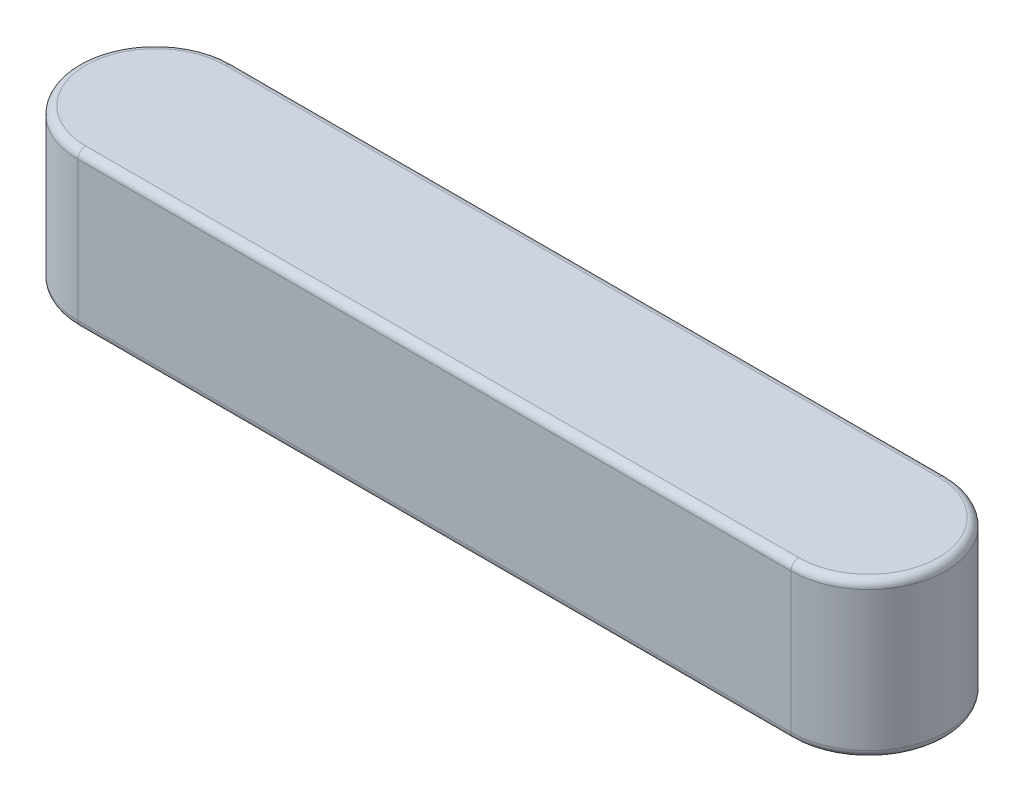
ISO-10303-21;
HEADER;
FILE_DESCRIPTION(('STEP AP214'),'2;1');
FILE_NAME('part.step','',(''),(''),'','','');
FILE_SCHEMA(('AUTOMOTIVE_DESIGN { 1 0 10303 214 1 1 1 1 }'));
ENDSEC;
DATA;
#1=APPLICATION_CONTEXT('core data for automotive mechanical design processes');
#2=APPLICATION_PROTOCOL_DEFINITION('international standard','automotive_design',2000,#1);
#3=PRODUCT_CONTEXT('',#1,'mechanical');
#4=PRODUCT('Part','Part','',(#3));
#5=PRODUCT_RELATED_PRODUCT_CATEGORY('part','',(#4));
#6=PRODUCT_DEFINITION_FORMATION('','',#4);
#7=PRODUCT_DEFINITION_CONTEXT('part definition',#1,'design');
#8=PRODUCT_DEFINITION('design','',#6,#7);
#9=PRODUCT_DEFINITION_SHAPE('','',#8);
#10=(LENGTH_UNIT() NAMED_UNIT(*) SI_UNIT(.MILLI.,.METRE.));
#11=(NAMED_UNIT(*) PLANE_ANGLE_UNIT() SI_UNIT($,.RADIAN.));
#12=(NAMED_UNIT(*) SI_UNIT($,.STERADIAN.) SOLID_ANGLE_UNIT());
#13=UNCERTAINTY_MEASURE_WITH_UNIT(LENGTH_MEASURE(1.E-05),#10,'distance_accuracy_value','');
#14=(GEOMETRIC_REPRESENTATION_CONTEXT(3) GLOBAL_UNCERTAINTY_ASSIGNED_CONTEXT((#13)) GLOBAL_UNIT_ASSIGNED_CONTEXT((#10,
#11,#12)) REPRESENTATION_CONTEXT('',''));
#15=CARTESIAN_POINT('',(0.,0.,0.));
#16=DIRECTION('',(0.,0.,1.));
#17=DIRECTION('',(1.,0.,0.));
#18=AXIS2_PLACEMENT_3D('',#15,#16,#17);
#19=CARTESIAN_POINT('',(-23.,5.,0.));
#20=DIRECTION('',(0.,-1.,0.));
#21=DIRECTION('',(0.,0.,-1.));
#22=AXIS2_PLACEMENT_3D('',#19,#20,#21);
#23=CYLINDRICAL_SURFACE('',#22,2.5);
#24=DIRECTION('',(0.,-1.,0.));
#25=VECTOR('',#24,1.);
#26=CARTESIAN_POINT('',(-23.,5.,-2.5));
#27=LINE('',#26,#25);
#28=CARTESIAN_POINT('',(-23.,4.75,-2.5));
#29=VERTEX_POINT('',#28);
#30=CARTESIAN_POINT('',(-23.,0.25,-2.5));
#31=VERTEX_POINT('',#30);
#32=EDGE_CURVE('E104',#29,#31,#27,.T.);
#33=ORIENTED_EDGE('',*,*,#32,.T.);
#34=CARTESIAN_POINT('',(-23.,0.25,0.));
#35=DIRECTION('',(0.,1.,0.));
#36=DIRECTION('',(0.,0.,1.));
#37=AXIS2_PLACEMENT_3D('',#34,#35,#36);
#38=CIRCLE('',#37,2.5);
#39=CARTESIAN_POINT('',(-23.,0.25,2.5));
#40=VERTEX_POINT('',#39);
#41=EDGE_CURVE('E111',#31,#40,#38,.T.);
#42=ORIENTED_EDGE('',*,*,#41,.T.);
#43=DIRECTION('',(0.,-1.,0.));
#44=VECTOR('',#43,1.);
#45=CARTESIAN_POINT('',(-23.,5.,2.5));
#46=LINE('',#45,#44);
#47=CARTESIAN_POINT('',(-23.,4.75,2.5));
#48=VERTEX_POINT('',#47);
#49=EDGE_CURVE('E106',#48,#40,#46,.T.);
#50=ORIENTED_EDGE('',*,*,#49,.F.);
#51=CARTESIAN_POINT('',(-23.,4.75,0.));
#52=DIRECTION('',(0.,1.,0.));
#53=DIRECTION('',(0.,0.,1.));
#54=AXIS2_PLACEMENT_3D('',#51,#52,#53);
#55=CIRCLE('',#54,2.5);
#56=EDGE_CURVE('E102',#48,#29,#55,.F.);
#57=ORIENTED_EDGE('',*,*,#56,.T.);
#58=EDGE_LOOP('',(#33,#42,#50,#57));
#59=FACE_BOUND('',#58,.T.);
#60=ADVANCED_FACE('F33',(#59),#23,.T.);
#61=CARTESIAN_POINT('',(-23.,5.,2.5));
#62=DIRECTION('',(0.,0.,-1.));
#63=DIRECTION('',(-1.,0.,0.));
#64=AXIS2_PLACEMENT_3D('',#61,#62,#63);
#65=PLANE('',#64);
#66=ORIENTED_EDGE('',*,*,#49,.T.);
#67=DIRECTION('',(1.,0.,0.));
#68=VECTOR('',#67,1.);
#69=CARTESIAN_POINT('',(-23.,0.25,2.5));
#70=LINE('',#69,#68);
#71=CARTESIAN_POINT('',(0.,0.25,2.5));
#72=VERTEX_POINT('',#71);
#73=EDGE_CURVE('E155',#40,#72,#70,.T.);
#74=ORIENTED_EDGE('',*,*,#73,.T.);
#75=DIRECTION('',(0.,-1.,0.));
#76=VECTOR('',#75,1.);
#77=CARTESIAN_POINT('',(0.,5.,2.5));
#78=LINE('',#77,#76);
#79=CARTESIAN_POINT('',(0.,4.75,2.5));
#80=VERTEX_POINT('',#79);
#81=EDGE_CURVE('E136',#80,#72,#78,.T.);
#82=ORIENTED_EDGE('',*,*,#81,.F.);
#83=DIRECTION('',(1.,0.,0.));
#84=VECTOR('',#83,1.);
#85=CARTESIAN_POINT('',(-23.,4.75,2.5));
#86=LINE('',#85,#84);
#87=EDGE_CURVE('E153',#80,#48,#86,.F.);
#88=ORIENTED_EDGE('',*,*,#87,.T.);
#89=EDGE_LOOP('',(#66,#74,#82,#88));
#90=FACE_BOUND('',#89,.T.);
#91=ADVANCED_FACE('F181',(#90),#65,.F.);
#92=CARTESIAN_POINT('',(0.,5.,0.));
#93=DIRECTION('',(0.,-1.,0.));
#94=DIRECTION('',(0.,0.,-1.));
#95=AXIS2_PLACEMENT_3D('',#92,#93,#94);
#96=CYLINDRICAL_SURFACE('',#95,2.5);
#97=ORIENTED_EDGE('',*,*,#81,.T.);
#98=CARTESIAN_POINT('',(0.,0.25,0.));
#99=DIRECTION('',(0.,1.,0.));
#100=DIRECTION('',(0.,0.,1.));
#101=AXIS2_PLACEMENT_3D('',#98,#99,#100);
#102=CIRCLE('',#101,2.5);
#103=CARTESIAN_POINT('',(0.,0.25,-2.5));
#104=VERTEX_POINT('',#103);
#105=EDGE_CURVE('E112',#72,#104,#102,.T.);
#106=ORIENTED_EDGE('',*,*,#105,.T.);
#107=DIRECTION('',(0.,-1.,0.));
#108=VECTOR('',#107,1.);
#109=CARTESIAN_POINT('',(0.,5.,-2.5));
#110=LINE('',#109,#108);
#111=CARTESIAN_POINT('',(0.,4.75,-2.5));
#112=VERTEX_POINT('',#111);
#113=EDGE_CURVE('E123',#112,#104,#110,.T.);
#114=ORIENTED_EDGE('',*,*,#113,.F.);
#115=CARTESIAN_POINT('',(0.,4.75,0.));
#116=DIRECTION('',(0.,1.,0.));
#117=DIRECTION('',(0.,0.,1.));
#118=AXIS2_PLACEMENT_3D('',#115,#116,#117);
#119=CIRCLE('',#118,2.5);
#120=EDGE_CURVE('E148',#112,#80,#119,.F.);
#121=ORIENTED_EDGE('',*,*,#120,.T.);
#122=EDGE_LOOP('',(#97,#106,#114,#121));
#123=FACE_BOUND('',#122,.T.);
#124=ADVANCED_FACE('F179',(#123),#96,.T.);
#125=CARTESIAN_POINT('',(-23.,5.,-2.5));
#126=DIRECTION('',(0.,0.,1.));
#127=DIRECTION('',(1.,0.,0.));
#128=AXIS2_PLACEMENT_3D('',#125,#126,#127);
#129=PLANE('',#128);
#130=ORIENTED_EDGE('',*,*,#113,.T.);
#131=DIRECTION('',(-1.,0.,0.));
#132=VECTOR('',#131,1.);
#133=CARTESIAN_POINT('',(-23.,0.25,-2.5));
#134=LINE('',#133,#132);
#135=EDGE_CURVE('E122',#104,#31,#134,.T.);
#136=ORIENTED_EDGE('',*,*,#135,.T.);
#137=ORIENTED_EDGE('',*,*,#32,.F.);
#138=DIRECTION('',(-1.,0.,0.));
#139=VECTOR('',#138,1.);
#140=CARTESIAN_POINT('',(0.,4.75,-2.5));
#141=LINE('',#140,#139);
#142=EDGE_CURVE('E119',#29,#112,#141,.F.);
#143=ORIENTED_EDGE('',*,*,#142,.T.);
#144=EDGE_LOOP('',(#130,#136,#137,#143));
#145=FACE_BOUND('',#144,.T.);
#146=ADVANCED_FACE('F117',(#145),#129,.F.);
#147=CARTESIAN_POINT('',(-23.,5.,0.));
#148=DIRECTION('',(0.,1.,0.));
#149=DIRECTION('',(0.,0.,1.));
#150=AXIS2_PLACEMENT_3D('',#147,#148,#149);
#151=PLANE('',#150);
#152=DIRECTION('',(1.,0.,0.));
#153=VECTOR('',#152,1.);
#154=CARTESIAN_POINT('',(0.,5.,2.25));
#155=LINE('',#154,#153);
#156=CARTESIAN_POINT('',(-23.,5.,2.25));
#157=VERTEX_POINT('',#156);
#158=CARTESIAN_POINT('',(0.,5.,2.25));
#159=VERTEX_POINT('',#158);
#160=EDGE_CURVE('E42',#157,#159,#155,.T.);
#161=ORIENTED_EDGE('',*,*,#160,.T.);
#162=CARTESIAN_POINT('',(0.,5.,0.));
#163=DIRECTION('',(0.,1.,0.));
#164=DIRECTION('',(0.,0.,1.));
#165=AXIS2_PLACEMENT_3D('',#162,#163,#164);
#166=CIRCLE('',#165,2.25);
#167=CARTESIAN_POINT('',(0.,5.,-2.25));
#168=VERTEX_POINT('',#167);
#169=EDGE_CURVE('E11',#159,#168,#166,.T.);
#170=ORIENTED_EDGE('',*,*,#169,.T.);
#171=DIRECTION('',(-1.,0.,0.));
#172=VECTOR('',#171,1.);
#173=CARTESIAN_POINT('',(-23.,5.,-2.25));
#174=LINE('',#173,#172);
#175=CARTESIAN_POINT('',(-23.,5.,-2.25));
#176=VERTEX_POINT('',#175);
#177=EDGE_CURVE('E158',#168,#176,#174,.T.);
#178=ORIENTED_EDGE('',*,*,#177,.T.);
#179=CARTESIAN_POINT('',(-23.,5.,0.));
#180=DIRECTION('',(0.,1.,0.));
#181=DIRECTION('',(0.,0.,1.));
#182=AXIS2_PLACEMENT_3D('',#179,#180,#181);
#183=CIRCLE('',#182,2.25);
#184=EDGE_CURVE('E129',#176,#157,#183,.T.);
#185=ORIENTED_EDGE('',*,*,#184,.T.);
#186=EDGE_LOOP('',(#161,#170,#178,#185));
#187=FACE_BOUND('',#186,.T.);
#188=ADVANCED_FACE('F204',(#187),#151,.T.);
#189=CARTESIAN_POINT('',(-23.,0.,0.));
#190=DIRECTION('',(0.,1.,0.));
#191=DIRECTION('',(0.,0.,1.));
#192=AXIS2_PLACEMENT_3D('',#189,#190,#191);
#193=PLANE('',#192);
#194=CARTESIAN_POINT('',(-23.,0.,0.));
#195=DIRECTION('',(0.,1.,0.));
#196=DIRECTION('',(0.,0.,1.));
#197=AXIS2_PLACEMENT_3D('',#194,#195,#196);
#198=CIRCLE('',#197,2.25);
#199=CARTESIAN_POINT('',(-23.,0.,2.25));
#200=VERTEX_POINT('',#199);
#201=CARTESIAN_POINT('',(-23.,0.,-2.25));
#202=VERTEX_POINT('',#201);
#203=EDGE_CURVE('E141',#200,#202,#198,.F.);
#204=ORIENTED_EDGE('',*,*,#203,.T.);
#205=DIRECTION('',(-1.,0.,0.));
#206=VECTOR('',#205,1.);
#207=CARTESIAN_POINT('',(-23.,0.,-2.25));
#208=LINE('',#207,#206);
#209=CARTESIAN_POINT('',(0.,0.,-2.25));
#210=VERTEX_POINT('',#209);
#211=EDGE_CURVE('E145',#202,#210,#208,.F.);
#212=ORIENTED_EDGE('',*,*,#211,.T.);
#213=CARTESIAN_POINT('',(0.,0.,0.));
#214=DIRECTION('',(0.,1.,0.));
#215=DIRECTION('',(0.,0.,1.));
#216=AXIS2_PLACEMENT_3D('',#213,#214,#215);
#217=CIRCLE('',#216,2.25);
#218=CARTESIAN_POINT('',(0.,0.,2.25));
#219=VERTEX_POINT('',#218);
#220=EDGE_CURVE('E143',#210,#219,#217,.F.);
#221=ORIENTED_EDGE('',*,*,#220,.T.);
#222=DIRECTION('',(1.,0.,0.));
#223=VECTOR('',#222,1.);
#224=CARTESIAN_POINT('',(-23.,0.,2.25));
#225=LINE('',#224,#223);
#226=EDGE_CURVE('E134',#219,#200,#225,.F.);
#227=ORIENTED_EDGE('',*,*,#226,.T.);
#228=EDGE_LOOP('',(#204,#212,#221,#227));
#229=FACE_BOUND('',#228,.T.);
#230=ADVANCED_FACE('F202',(#229),#193,.F.);
#231=CARTESIAN_POINT('',(-23.,0.25,2.25));
#232=DIRECTION('',(1.,0.,0.));
#233=DIRECTION('',(0.,0.,-1.));
#234=AXIS2_PLACEMENT_3D('',#231,#232,#233);
#235=CYLINDRICAL_SURFACE('',#234,0.25);
#236=CARTESIAN_POINT('',(-23.,0.25,2.25));
#237=DIRECTION('',(-1.,0.,0.));
#238=DIRECTION('',(0.,0.,1.));
#239=AXIS2_PLACEMENT_3D('',#236,#237,#238);
#240=CIRCLE('',#239,0.25);
#241=EDGE_CURVE('E165',#200,#40,#240,.T.);
#242=ORIENTED_EDGE('',*,*,#241,.F.);
#243=ORIENTED_EDGE('',*,*,#226,.F.);
#244=CARTESIAN_POINT('',(0.,0.25,2.25));
#245=DIRECTION('',(1.,0.,0.));
#246=DIRECTION('',(0.,0.,-1.));
#247=AXIS2_PLACEMENT_3D('',#244,#245,#246);
#248=CIRCLE('',#247,0.25);
#249=EDGE_CURVE('E124',#72,#219,#248,.T.);
#250=ORIENTED_EDGE('',*,*,#249,.F.);
#251=ORIENTED_EDGE('',*,*,#73,.F.);
#252=EDGE_LOOP('',(#242,#243,#250,#251));
#253=FACE_BOUND('',#252,.T.);
#254=ADVANCED_FACE('F199',(#253),#235,.T.);
#255=CARTESIAN_POINT('',(0.,0.25,0.));
#256=DIRECTION('',(0.,1.,0.));
#257=DIRECTION('',(0.,0.,1.));
#258=AXIS2_PLACEMENT_3D('',#255,#256,#257);
#259=TOROIDAL_SURFACE('',#258,2.25,0.25);
#260=ORIENTED_EDGE('',*,*,#249,.T.);
#261=ORIENTED_EDGE('',*,*,#220,.F.);
#262=CARTESIAN_POINT('',(0.,0.25,-2.25));
#263=DIRECTION('',(-1.,0.,0.));
#264=DIRECTION('',(0.,-1.,0.));
#265=AXIS2_PLACEMENT_3D('',#262,#263,#264);
#266=CIRCLE('',#265,0.25);
#267=EDGE_CURVE('E163',#104,#210,#266,.T.);
#268=ORIENTED_EDGE('',*,*,#267,.F.);
#269=ORIENTED_EDGE('',*,*,#105,.F.);
#270=EDGE_LOOP('',(#260,#261,#268,#269));
#271=FACE_BOUND('',#270,.T.);
#272=ADVANCED_FACE('F188',(#271),#259,.T.);
#273=CARTESIAN_POINT('',(-23.,0.25,0.));
#274=DIRECTION('',(0.,1.,0.));
#275=DIRECTION('',(0.,0.,1.));
#276=AXIS2_PLACEMENT_3D('',#273,#274,#275);
#277=TOROIDAL_SURFACE('',#276,2.25,0.25);
#278=ORIENTED_EDGE('',*,*,#241,.T.);
#279=ORIENTED_EDGE('',*,*,#41,.F.);
#280=CARTESIAN_POINT('',(-23.,0.25,-2.25));
#281=DIRECTION('',(1.,0.,0.));
#282=DIRECTION('',(0.,0.,-1.));
#283=AXIS2_PLACEMENT_3D('',#280,#281,#282);
#284=CIRCLE('',#283,0.25);
#285=EDGE_CURVE('E161',#202,#31,#284,.T.);
#286=ORIENTED_EDGE('',*,*,#285,.F.);
#287=ORIENTED_EDGE('',*,*,#203,.F.);
#288=EDGE_LOOP('',(#278,#279,#286,#287));
#289=FACE_BOUND('',#288,.T.);
#290=ADVANCED_FACE('F196',(#289),#277,.T.);
#291=CARTESIAN_POINT('',(-23.,0.25,-2.25));
#292=DIRECTION('',(-1.,0.,0.));
#293=DIRECTION('',(0.,0.,1.));
#294=AXIS2_PLACEMENT_3D('',#291,#292,#293);
#295=CYLINDRICAL_SURFACE('',#294,0.25);
#296=ORIENTED_EDGE('',*,*,#267,.T.);
#297=ORIENTED_EDGE('',*,*,#211,.F.);
#298=ORIENTED_EDGE('',*,*,#285,.T.);
#299=ORIENTED_EDGE('',*,*,#135,.F.);
#300=EDGE_LOOP('',(#296,#297,#298,#299));
#301=FACE_BOUND('',#300,.T.);
#302=ADVANCED_FACE('F191',(#301),#295,.T.);
#303=CARTESIAN_POINT('',(-23.,4.75,0.));
#304=DIRECTION('',(0.,1.,0.));
#305=DIRECTION('',(0.,0.,1.));
#306=AXIS2_PLACEMENT_3D('',#303,#304,#305);
#307=TOROIDAL_SURFACE('',#306,2.25,0.25);
#308=CARTESIAN_POINT('',(-23.,4.75,-2.25));
#309=DIRECTION('',(1.,0.,0.));
#310=DIRECTION('',(0.,0.,-1.));
#311=AXIS2_PLACEMENT_3D('',#308,#309,#310);
#312=CIRCLE('',#311,0.25);
#313=EDGE_CURVE('E128',#29,#176,#312,.T.);
#314=ORIENTED_EDGE('',*,*,#313,.F.);
#315=ORIENTED_EDGE('',*,*,#56,.F.);
#316=CARTESIAN_POINT('',(-23.,4.75,2.25));
#317=DIRECTION('',(1.,0.,0.));
#318=DIRECTION('',(0.,0.,-1.));
#319=AXIS2_PLACEMENT_3D('',#316,#317,#318);
#320=CIRCLE('',#319,0.25);
#321=EDGE_CURVE('E37',#157,#48,#320,.T.);
#322=ORIENTED_EDGE('',*,*,#321,.F.);
#323=ORIENTED_EDGE('',*,*,#184,.F.);
#324=EDGE_LOOP('',(#314,#315,#322,#323));
#325=FACE_BOUND('',#324,.T.);
#326=ADVANCED_FACE('F35',(#325),#307,.T.);
#327=CARTESIAN_POINT('',(-23.,4.75,2.25));
#328=DIRECTION('',(-1.,0.,0.));
#329=DIRECTION('',(0.,0.,1.));
#330=AXIS2_PLACEMENT_3D('',#327,#328,#329);
#331=CYLINDRICAL_SURFACE('',#330,0.25);
#332=ORIENTED_EDGE('',*,*,#321,.T.);
#333=ORIENTED_EDGE('',*,*,#87,.F.);
#334=CARTESIAN_POINT('',(0.,4.75,2.25));
#335=DIRECTION('',(1.,0.,0.));
#336=DIRECTION('',(0.,0.,-1.));
#337=AXIS2_PLACEMENT_3D('',#334,#335,#336);
#338=CIRCLE('',#337,0.25);
#339=EDGE_CURVE('E131',#159,#80,#338,.T.);
#340=ORIENTED_EDGE('',*,*,#339,.F.);
#341=ORIENTED_EDGE('',*,*,#160,.F.);
#342=EDGE_LOOP('',(#332,#333,#340,#341));
#343=FACE_BOUND('',#342,.T.);
#344=ADVANCED_FACE('F174',(#343),#331,.T.);
#345=CARTESIAN_POINT('',(-23.,4.75,-2.25));
#346=DIRECTION('',(1.,0.,0.));
#347=DIRECTION('',(0.,0.,-1.));
#348=AXIS2_PLACEMENT_3D('',#345,#346,#347);
#349=CYLINDRICAL_SURFACE('',#348,0.25);
#350=ORIENTED_EDGE('',*,*,#313,.T.);
#351=ORIENTED_EDGE('',*,*,#177,.F.);
#352=CARTESIAN_POINT('',(0.,4.75,-2.25));
#353=DIRECTION('',(1.,0.,0.));
#354=DIRECTION('',(0.,0.,-1.));
#355=AXIS2_PLACEMENT_3D('',#352,#353,#354);
#356=CIRCLE('',#355,0.25);
#357=EDGE_CURVE('E56',#112,#168,#356,.T.);
#358=ORIENTED_EDGE('',*,*,#357,.F.);
#359=ORIENTED_EDGE('',*,*,#142,.F.);
#360=EDGE_LOOP('',(#350,#351,#358,#359));
#361=FACE_BOUND('',#360,.T.);
#362=ADVANCED_FACE('F132',(#361),#349,.T.);
#363=CARTESIAN_POINT('',(0.,4.75,0.));
#364=DIRECTION('',(0.,1.,0.));
#365=DIRECTION('',(0.,0.,1.));
#366=AXIS2_PLACEMENT_3D('',#363,#364,#365);
#367=TOROIDAL_SURFACE('',#366,2.25,0.25);
#368=ORIENTED_EDGE('',*,*,#339,.T.);
#369=ORIENTED_EDGE('',*,*,#120,.F.);
#370=ORIENTED_EDGE('',*,*,#357,.T.);
#371=ORIENTED_EDGE('',*,*,#169,.F.);
#372=EDGE_LOOP('',(#368,#369,#370,#371));
#373=FACE_BOUND('',#372,.T.);
#374=ADVANCED_FACE('F172',(#373),#367,.T.);
#375=CLOSED_SHELL('',(#60,#91,#124,#146,#188,#230,#254,#272,#290,#302,#326,#344,#362,#374));
#376=MANIFOLD_SOLID_BREP('B2',#375);
#377=ADVANCED_BREP_SHAPE_REPRESENTATION('',(#18,#376),#14);
#378=SHAPE_DEFINITION_REPRESENTATION(#9,#377);
ENDSEC;
END-ISO-10303-21;
